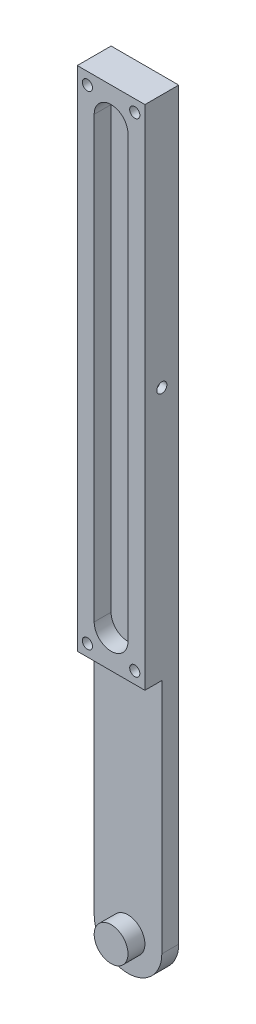
ISO-10303-21;
HEADER;
FILE_DESCRIPTION(('STEP AP214'),'2;1');
FILE_NAME('part.step','',(''),(''),'','','');
FILE_SCHEMA(('AUTOMOTIVE_DESIGN { 1 0 10303 214 1 1 1 1 }'));
ENDSEC;
DATA;
#1=APPLICATION_CONTEXT('core data for automotive mechanical design processes');
#2=APPLICATION_PROTOCOL_DEFINITION('international standard','automotive_design',2000,#1);
#3=PRODUCT_CONTEXT('',#1,'mechanical');
#4=PRODUCT('Part','Part','',(#3));
#5=PRODUCT_RELATED_PRODUCT_CATEGORY('part','',(#4));
#6=PRODUCT_DEFINITION_FORMATION('','',#4);
#7=PRODUCT_DEFINITION_CONTEXT('part definition',#1,'design');
#8=PRODUCT_DEFINITION('design','',#6,#7);
#9=PRODUCT_DEFINITION_SHAPE('','',#8);
#10=(LENGTH_UNIT() NAMED_UNIT(*) SI_UNIT(.MILLI.,.METRE.));
#11=(NAMED_UNIT(*) PLANE_ANGLE_UNIT() SI_UNIT($,.RADIAN.));
#12=(NAMED_UNIT(*) SI_UNIT($,.STERADIAN.) SOLID_ANGLE_UNIT());
#13=UNCERTAINTY_MEASURE_WITH_UNIT(LENGTH_MEASURE(1.E-05),#10,'distance_accuracy_value','');
#14=(GEOMETRIC_REPRESENTATION_CONTEXT(3) GLOBAL_UNCERTAINTY_ASSIGNED_CONTEXT((#13)) GLOBAL_UNIT_ASSIGNED_CONTEXT((#10,
#11,#12)) REPRESENTATION_CONTEXT('',''));
#15=CARTESIAN_POINT('',(0.,0.,0.));
#16=DIRECTION('',(0.,0.,1.));
#17=DIRECTION('',(1.,0.,0.));
#18=AXIS2_PLACEMENT_3D('',#15,#16,#17);
#19=CARTESIAN_POINT('',(10.,-150.,5.));
#20=DIRECTION('',(-1.,0.,0.));
#21=DIRECTION('',(0.,-1.,0.));
#22=AXIS2_PLACEMENT_3D('',#19,#20,#21);
#23=PLANE('',#22);
#24=DIRECTION('',(0.,1.,0.));
#25=VECTOR('',#24,1.);
#26=CARTESIAN_POINT('',(10.,-150.,-5.));
#27=LINE('',#26,#25);
#28=CARTESIAN_POINT('',(10.,-220.,-5.));
#29=VERTEX_POINT('',#28);
#30=CARTESIAN_POINT('',(10.,0.,-5.));
#31=VERTEX_POINT('',#30);
#32=EDGE_CURVE('E97',#29,#31,#27,.T.);
#33=ORIENTED_EDGE('',*,*,#32,.T.);
#34=DIRECTION('',(0.,0.,-1.));
#35=VECTOR('',#34,1.);
#36=CARTESIAN_POINT('',(10.,0.,5.));
#37=LINE('',#36,#35);
#38=CARTESIAN_POINT('',(10.,0.,5.));
#39=VERTEX_POINT('',#38);
#40=EDGE_CURVE('E10',#39,#31,#37,.T.);
#41=ORIENTED_EDGE('',*,*,#40,.F.);
#42=DIRECTION('',(0.,1.,0.));
#43=VECTOR('',#42,1.);
#44=CARTESIAN_POINT('',(10.,-150.,5.));
#45=LINE('',#44,#43);
#46=CARTESIAN_POINT('',(10.,-150.,5.));
#47=VERTEX_POINT('',#46);
#48=EDGE_CURVE('E180',#47,#39,#45,.T.);
#49=ORIENTED_EDGE('',*,*,#48,.F.);
#50=DIRECTION('',(0.,0.,-1.));
#51=VECTOR('',#50,1.);
#52=CARTESIAN_POINT('',(10.,-150.,5.));
#53=LINE('',#52,#51);
#54=CARTESIAN_POINT('',(10.,-150.,0.));
#55=VERTEX_POINT('',#54);
#56=EDGE_CURVE('E189',#47,#55,#53,.T.);
#57=ORIENTED_EDGE('',*,*,#56,.T.);
#58=DIRECTION('',(0.,1.,0.));
#59=VECTOR('',#58,1.);
#60=CARTESIAN_POINT('',(10.,-150.,0.));
#61=LINE('',#60,#59);
#62=CARTESIAN_POINT('',(10.,-220.,0.));
#63=VERTEX_POINT('',#62);
#64=EDGE_CURVE('E113',#63,#55,#61,.T.);
#65=ORIENTED_EDGE('',*,*,#64,.F.);
#66=DIRECTION('',(0.,0.,1.));
#67=VECTOR('',#66,1.);
#68=CARTESIAN_POINT('',(10.,-220.,-87.4621125123532));
#69=LINE('',#68,#67);
#70=EDGE_CURVE('E110',#29,#63,#69,.T.);
#71=ORIENTED_EDGE('',*,*,#70,.F.);
#72=EDGE_LOOP('',(#33,#41,#49,#57,#65,#71));
#73=FACE_BOUND('',#72,.T.);
#74=CARTESIAN_POINT('',(10.,-75.,0.));
#75=DIRECTION('',(-1.,0.,0.));
#76=DIRECTION('',(0.,-1.,0.));
#77=AXIS2_PLACEMENT_3D('',#74,#75,#76);
#78=CIRCLE('',#77,1.5);
#79=CARTESIAN_POINT('',(10.,-76.5,0.));
#80=VERTEX_POINT('',#79);
#81=EDGE_CURVE('E214',#80,#80,#78,.T.);
#82=ORIENTED_EDGE('',*,*,#81,.T.);
#83=EDGE_LOOP('',(#82));
#84=FACE_BOUND('',#83,.T.);
#85=ADVANCED_FACE('F18',(#73,#84),#23,.F.);
#86=CARTESIAN_POINT('',(0.,-220.,0.));
#87=DIRECTION('',(0.,0.,1.));
#88=DIRECTION('',(0.,-1.,0.));
#89=AXIS2_PLACEMENT_3D('',#86,#87,#88);
#90=PLANE('',#89);
#91=DIRECTION('',(0.,-1.,0.));
#92=VECTOR('',#91,1.);
#93=CARTESIAN_POINT('',(-10.,-150.,0.));
#94=LINE('',#93,#92);
#95=CARTESIAN_POINT('',(-10.,-150.,0.));
#96=VERTEX_POINT('',#95);
#97=CARTESIAN_POINT('',(-10.,-220.,0.));
#98=VERTEX_POINT('',#97);
#99=EDGE_CURVE('E201',#96,#98,#94,.T.);
#100=ORIENTED_EDGE('',*,*,#99,.T.);
#101=CARTESIAN_POINT('',(0.,-220.,0.));
#102=DIRECTION('',(0.,0.,1.));
#103=DIRECTION('',(0.,-1.,0.));
#104=AXIS2_PLACEMENT_3D('',#101,#102,#103);
#105=CIRCLE('',#104,10.);
#106=EDGE_CURVE('E123',#98,#63,#105,.T.);
#107=ORIENTED_EDGE('',*,*,#106,.T.);
#108=ORIENTED_EDGE('',*,*,#64,.T.);
#109=DIRECTION('',(-1.,0.,0.));
#110=VECTOR('',#109,1.);
#111=CARTESIAN_POINT('',(-10.,-150.,0.));
#112=LINE('',#111,#110);
#113=EDGE_CURVE('E34',#55,#96,#112,.T.);
#114=ORIENTED_EDGE('',*,*,#113,.T.);
#115=EDGE_LOOP('',(#100,#107,#108,#114));
#116=FACE_BOUND('',#115,.T.);
#117=CARTESIAN_POINT('',(0.,-220.,0.));
#118=DIRECTION('',(0.,0.,1.));
#119=DIRECTION('',(0.,-1.,0.));
#120=AXIS2_PLACEMENT_3D('',#117,#118,#119);
#121=CIRCLE('',#120,5.);
#122=CARTESIAN_POINT('',(0.,-225.,0.));
#123=VERTEX_POINT('',#122);
#124=EDGE_CURVE('E208',#123,#123,#121,.T.);
#125=ORIENTED_EDGE('',*,*,#124,.F.);
#126=EDGE_LOOP('',(#125));
#127=FACE_BOUND('',#126,.T.);
#128=ADVANCED_FACE('F233',(#116,#127),#90,.T.);
#129=CARTESIAN_POINT('',(-10.,-150.,5.));
#130=DIRECTION('',(0.,1.,0.));
#131=DIRECTION('',(-1.,0.,0.));
#132=AXIS2_PLACEMENT_3D('',#129,#130,#131);
#133=PLANE('',#132);
#134=ORIENTED_EDGE('',*,*,#113,.F.);
#135=ORIENTED_EDGE('',*,*,#56,.F.);
#136=DIRECTION('',(1.,0.,0.));
#137=VECTOR('',#136,1.);
#138=CARTESIAN_POINT('',(-10.,-150.,5.));
#139=LINE('',#138,#137);
#140=CARTESIAN_POINT('',(-10.,-150.,5.));
#141=VERTEX_POINT('',#140);
#142=EDGE_CURVE('E188',#141,#47,#139,.T.);
#143=ORIENTED_EDGE('',*,*,#142,.F.);
#144=DIRECTION('',(0.,0.,-1.));
#145=VECTOR('',#144,1.);
#146=CARTESIAN_POINT('',(-10.,-150.,5.));
#147=LINE('',#146,#145);
#148=EDGE_CURVE('E199',#141,#96,#147,.T.);
#149=ORIENTED_EDGE('',*,*,#148,.T.);
#150=EDGE_LOOP('',(#134,#135,#143,#149));
#151=FACE_BOUND('',#150,.T.);
#152=ADVANCED_FACE('F237',(#151),#133,.F.);
#153=CARTESIAN_POINT('',(-10.,0.,5.));
#154=DIRECTION('',(0.,-1.,0.));
#155=DIRECTION('',(1.,0.,0.));
#156=AXIS2_PLACEMENT_3D('',#153,#154,#155);
#157=PLANE('',#156);
#158=DIRECTION('',(-1.,0.,0.));
#159=VECTOR('',#158,1.);
#160=CARTESIAN_POINT('',(-10.,0.,-5.));
#161=LINE('',#160,#159);
#162=CARTESIAN_POINT('',(-10.,0.,-5.));
#163=VERTEX_POINT('',#162);
#164=EDGE_CURVE('E104',#31,#163,#161,.T.);
#165=ORIENTED_EDGE('',*,*,#164,.T.);
#166=DIRECTION('',(0.,0.,-1.));
#167=VECTOR('',#166,1.);
#168=CARTESIAN_POINT('',(-10.,0.,5.));
#169=LINE('',#168,#167);
#170=CARTESIAN_POINT('',(-10.,0.,5.));
#171=VERTEX_POINT('',#170);
#172=EDGE_CURVE('E26',#171,#163,#169,.T.);
#173=ORIENTED_EDGE('',*,*,#172,.F.);
#174=DIRECTION('',(-1.,0.,0.));
#175=VECTOR('',#174,1.);
#176=CARTESIAN_POINT('',(-10.,0.,5.));
#177=LINE('',#176,#175);
#178=EDGE_CURVE('E183',#39,#171,#177,.T.);
#179=ORIENTED_EDGE('',*,*,#178,.F.);
#180=ORIENTED_EDGE('',*,*,#40,.T.);
#181=EDGE_LOOP('',(#165,#173,#179,#180));
#182=FACE_BOUND('',#181,.T.);
#183=ADVANCED_FACE('F243',(#182),#157,.F.);
#184=CARTESIAN_POINT('',(-10.,-150.,5.));
#185=DIRECTION('',(1.,0.,0.));
#186=DIRECTION('',(0.,1.,0.));
#187=AXIS2_PLACEMENT_3D('',#184,#185,#186);
#188=PLANE('',#187);
#189=DIRECTION('',(0.,-1.,0.));
#190=VECTOR('',#189,1.);
#191=CARTESIAN_POINT('',(-10.,-150.,-5.));
#192=LINE('',#191,#190);
#193=CARTESIAN_POINT('',(-10.,-220.,-5.));
#194=VERTEX_POINT('',#193);
#195=EDGE_CURVE('E184',#163,#194,#192,.T.);
#196=ORIENTED_EDGE('',*,*,#195,.T.);
#197=DIRECTION('',(0.,0.,1.));
#198=VECTOR('',#197,1.);
#199=CARTESIAN_POINT('',(-10.,-220.,-87.4621125123532));
#200=LINE('',#199,#198);
#201=EDGE_CURVE('E117',#194,#98,#200,.T.);
#202=ORIENTED_EDGE('',*,*,#201,.T.);
#203=ORIENTED_EDGE('',*,*,#99,.F.);
#204=ORIENTED_EDGE('',*,*,#148,.F.);
#205=DIRECTION('',(0.,-1.,0.));
#206=VECTOR('',#205,1.);
#207=CARTESIAN_POINT('',(-10.,-150.,5.));
#208=LINE('',#207,#206);
#209=EDGE_CURVE('E186',#171,#141,#208,.T.);
#210=ORIENTED_EDGE('',*,*,#209,.F.);
#211=ORIENTED_EDGE('',*,*,#172,.T.);
#212=EDGE_LOOP('',(#196,#202,#203,#204,#210,#211));
#213=FACE_BOUND('',#212,.T.);
#214=ADVANCED_FACE('F306',(#213),#188,.F.);
#215=CARTESIAN_POINT('',(0.,-75.,5.));
#216=DIRECTION('',(0.,0.,-1.));
#217=DIRECTION('',(0.,1.,0.));
#218=AXIS2_PLACEMENT_3D('',#215,#216,#217);
#219=PLANE('',#218);
#220=CARTESIAN_POINT('',(7.,-146.5,5.));
#221=DIRECTION('',(0.,0.,1.));
#222=DIRECTION('',(0.,-1.,0.));
#223=AXIS2_PLACEMENT_3D('',#220,#221,#222);
#224=CIRCLE('',#223,1.5);
#225=CARTESIAN_POINT('',(7.,-148.,5.));
#226=VERTEX_POINT('',#225);
#227=EDGE_CURVE('E127',#226,#226,#224,.T.);
#228=ORIENTED_EDGE('',*,*,#227,.F.);
#229=EDGE_LOOP('',(#228));
#230=FACE_BOUND('',#229,.T.);
#231=CARTESIAN_POINT('',(-7.,-146.5,5.));
#232=DIRECTION('',(0.,0.,1.));
#233=DIRECTION('',(0.,-1.,0.));
#234=AXIS2_PLACEMENT_3D('',#231,#232,#233);
#235=CIRCLE('',#234,1.5);
#236=CARTESIAN_POINT('',(-7.,-148.,5.));
#237=VERTEX_POINT('',#236);
#238=EDGE_CURVE('E131',#237,#237,#235,.T.);
#239=ORIENTED_EDGE('',*,*,#238,.F.);
#240=EDGE_LOOP('',(#239));
#241=FACE_BOUND('',#240,.T.);
#242=CARTESIAN_POINT('',(-7.,-3.5,5.));
#243=DIRECTION('',(0.,0.,1.));
#244=DIRECTION('',(0.,-1.,0.));
#245=AXIS2_PLACEMENT_3D('',#242,#243,#244);
#246=CIRCLE('',#245,1.5);
#247=CARTESIAN_POINT('',(-7.,-5.,5.));
#248=VERTEX_POINT('',#247);
#249=EDGE_CURVE('E137',#248,#248,#246,.T.);
#250=ORIENTED_EDGE('',*,*,#249,.F.);
#251=EDGE_LOOP('',(#250));
#252=FACE_BOUND('',#251,.T.);
#253=CARTESIAN_POINT('',(7.,-3.5,5.));
#254=DIRECTION('',(0.,0.,1.));
#255=DIRECTION('',(0.,-1.,0.));
#256=AXIS2_PLACEMENT_3D('',#253,#254,#255);
#257=CIRCLE('',#256,1.5);
#258=CARTESIAN_POINT('',(7.,-5.,5.));
#259=VERTEX_POINT('',#258);
#260=EDGE_CURVE('E143',#259,#259,#257,.T.);
#261=ORIENTED_EDGE('',*,*,#260,.F.);
#262=EDGE_LOOP('',(#261));
#263=FACE_BOUND('',#262,.T.);
#264=DIRECTION('',(0.,1.,0.));
#265=VECTOR('',#264,1.);
#266=CARTESIAN_POINT('',(5.,-140.,5.));
#267=LINE('',#266,#265);
#268=CARTESIAN_POINT('',(5.,-140.,5.));
#269=VERTEX_POINT('',#268);
#270=CARTESIAN_POINT('',(5.,-10.,5.));
#271=VERTEX_POINT('',#270);
#272=EDGE_CURVE('E166',#269,#271,#267,.T.);
#273=ORIENTED_EDGE('',*,*,#272,.F.);
#274=CARTESIAN_POINT('',(0.,-140.,5.));
#275=DIRECTION('',(0.,0.,1.));
#276=DIRECTION('',(0.,-1.,0.));
#277=AXIS2_PLACEMENT_3D('',#274,#275,#276);
#278=CIRCLE('',#277,5.);
#279=CARTESIAN_POINT('',(-5.,-140.,5.));
#280=VERTEX_POINT('',#279);
#281=EDGE_CURVE('E42',#280,#269,#278,.T.);
#282=ORIENTED_EDGE('',*,*,#281,.F.);
#283=DIRECTION('',(0.,-1.,0.));
#284=VECTOR('',#283,1.);
#285=CARTESIAN_POINT('',(-5.,-140.,5.));
#286=LINE('',#285,#284);
#287=CARTESIAN_POINT('',(-5.,-10.,5.));
#288=VERTEX_POINT('',#287);
#289=EDGE_CURVE('E155',#288,#280,#286,.T.);
#290=ORIENTED_EDGE('',*,*,#289,.F.);
#291=CARTESIAN_POINT('',(0.,-10.,5.));
#292=DIRECTION('',(0.,0.,1.));
#293=DIRECTION('',(0.,-1.,0.));
#294=AXIS2_PLACEMENT_3D('',#291,#292,#293);
#295=CIRCLE('',#294,5.);
#296=EDGE_CURVE('E169',#271,#288,#295,.T.);
#297=ORIENTED_EDGE('',*,*,#296,.F.);
#298=EDGE_LOOP('',(#273,#282,#290,#297));
#299=FACE_BOUND('',#298,.T.);
#300=ORIENTED_EDGE('',*,*,#48,.T.);
#301=ORIENTED_EDGE('',*,*,#178,.T.);
#302=ORIENTED_EDGE('',*,*,#209,.T.);
#303=ORIENTED_EDGE('',*,*,#142,.T.);
#304=EDGE_LOOP('',(#300,#301,#302,#303));
#305=FACE_BOUND('',#304,.T.);
#306=ADVANCED_FACE('F303',(#230,#241,#252,#263,#299,#305),#219,.F.);
#307=CARTESIAN_POINT('',(0.,-75.,-5.));
#308=DIRECTION('',(0.,0.,-1.));
#309=DIRECTION('',(0.,1.,0.));
#310=AXIS2_PLACEMENT_3D('',#307,#308,#309);
#311=PLANE('',#310);
#312=ORIENTED_EDGE('',*,*,#32,.F.);
#313=CARTESIAN_POINT('',(0.,-220.,-5.));
#314=DIRECTION('',(0.,0.,-1.));
#315=DIRECTION('',(0.,1.,0.));
#316=AXIS2_PLACEMENT_3D('',#313,#314,#315);
#317=CIRCLE('',#316,10.);
#318=EDGE_CURVE('E102',#194,#29,#317,.F.);
#319=ORIENTED_EDGE('',*,*,#318,.F.);
#320=ORIENTED_EDGE('',*,*,#195,.F.);
#321=ORIENTED_EDGE('',*,*,#164,.F.);
#322=EDGE_LOOP('',(#312,#319,#320,#321));
#323=FACE_BOUND('',#322,.T.);
#324=ADVANCED_FACE('F99',(#323),#311,.T.);
#325=CARTESIAN_POINT('',(0.,-140.,0.));
#326=DIRECTION('',(0.,0.,1.));
#327=DIRECTION('',(0.,-1.,0.));
#328=AXIS2_PLACEMENT_3D('',#325,#326,#327);
#329=CYLINDRICAL_SURFACE('',#328,5.);
#330=ORIENTED_EDGE('',*,*,#281,.T.);
#331=DIRECTION('',(0.,0.,1.));
#332=VECTOR('',#331,1.);
#333=CARTESIAN_POINT('',(5.,-140.,0.));
#334=LINE('',#333,#332);
#335=CARTESIAN_POINT('',(5.,-140.,0.));
#336=VERTEX_POINT('',#335);
#337=EDGE_CURVE('E164',#336,#269,#334,.T.);
#338=ORIENTED_EDGE('',*,*,#337,.F.);
#339=CARTESIAN_POINT('',(0.,-140.,0.));
#340=DIRECTION('',(0.,0.,1.));
#341=DIRECTION('',(0.,-1.,0.));
#342=AXIS2_PLACEMENT_3D('',#339,#340,#341);
#343=CIRCLE('',#342,5.);
#344=CARTESIAN_POINT('',(-5.,-140.,0.));
#345=VERTEX_POINT('',#344);
#346=EDGE_CURVE('E151',#345,#336,#343,.T.);
#347=ORIENTED_EDGE('',*,*,#346,.F.);
#348=DIRECTION('',(0.,0.,1.));
#349=VECTOR('',#348,1.);
#350=CARTESIAN_POINT('',(-5.,-140.,0.));
#351=LINE('',#350,#349);
#352=EDGE_CURVE('E107',#345,#280,#351,.T.);
#353=ORIENTED_EDGE('',*,*,#352,.T.);
#354=EDGE_LOOP('',(#330,#338,#347,#353));
#355=FACE_BOUND('',#354,.T.);
#356=ADVANCED_FACE('F293',(#355),#329,.F.);
#357=CARTESIAN_POINT('',(-5.,-140.,0.));
#358=DIRECTION('',(-1.,0.,0.));
#359=DIRECTION('',(0.,-1.,0.));
#360=AXIS2_PLACEMENT_3D('',#357,#358,#359);
#361=PLANE('',#360);
#362=ORIENTED_EDGE('',*,*,#289,.T.);
#363=ORIENTED_EDGE('',*,*,#352,.F.);
#364=DIRECTION('',(0.,-1.,0.));
#365=VECTOR('',#364,1.);
#366=CARTESIAN_POINT('',(-5.,-140.,0.));
#367=LINE('',#366,#365);
#368=CARTESIAN_POINT('',(-5.,-10.,0.));
#369=VERTEX_POINT('',#368);
#370=EDGE_CURVE('E161',#369,#345,#367,.T.);
#371=ORIENTED_EDGE('',*,*,#370,.F.);
#372=DIRECTION('',(0.,0.,1.));
#373=VECTOR('',#372,1.);
#374=CARTESIAN_POINT('',(-5.,-10.,0.));
#375=LINE('',#374,#373);
#376=EDGE_CURVE('E175',#369,#288,#375,.T.);
#377=ORIENTED_EDGE('',*,*,#376,.T.);
#378=EDGE_LOOP('',(#362,#363,#371,#377));
#379=FACE_BOUND('',#378,.T.);
#380=ADVANCED_FACE('F289',(#379),#361,.F.);
#381=CARTESIAN_POINT('',(0.,-10.,0.));
#382=DIRECTION('',(0.,0.,1.));
#383=DIRECTION('',(0.,-1.,0.));
#384=AXIS2_PLACEMENT_3D('',#381,#382,#383);
#385=CYLINDRICAL_SURFACE('',#384,5.);
#386=ORIENTED_EDGE('',*,*,#296,.T.);
#387=ORIENTED_EDGE('',*,*,#376,.F.);
#388=CARTESIAN_POINT('',(0.,-10.,0.));
#389=DIRECTION('',(0.,0.,1.));
#390=DIRECTION('',(0.,-1.,0.));
#391=AXIS2_PLACEMENT_3D('',#388,#389,#390);
#392=CIRCLE('',#391,5.);
#393=CARTESIAN_POINT('',(5.,-10.,0.));
#394=VERTEX_POINT('',#393);
#395=EDGE_CURVE('E158',#394,#369,#392,.T.);
#396=ORIENTED_EDGE('',*,*,#395,.F.);
#397=DIRECTION('',(0.,0.,1.));
#398=VECTOR('',#397,1.);
#399=CARTESIAN_POINT('',(5.,-10.,0.));
#400=LINE('',#399,#398);
#401=EDGE_CURVE('E177',#394,#271,#400,.T.);
#402=ORIENTED_EDGE('',*,*,#401,.T.);
#403=EDGE_LOOP('',(#386,#387,#396,#402));
#404=FACE_BOUND('',#403,.T.);
#405=ADVANCED_FACE('F292',(#404),#385,.F.);
#406=CARTESIAN_POINT('',(5.,-140.,0.));
#407=DIRECTION('',(1.,0.,0.));
#408=DIRECTION('',(0.,1.,0.));
#409=AXIS2_PLACEMENT_3D('',#406,#407,#408);
#410=PLANE('',#409);
#411=ORIENTED_EDGE('',*,*,#272,.T.);
#412=ORIENTED_EDGE('',*,*,#401,.F.);
#413=DIRECTION('',(0.,1.,0.));
#414=VECTOR('',#413,1.);
#415=CARTESIAN_POINT('',(5.,-140.,0.));
#416=LINE('',#415,#414);
#417=EDGE_CURVE('E154',#336,#394,#416,.T.);
#418=ORIENTED_EDGE('',*,*,#417,.F.);
#419=ORIENTED_EDGE('',*,*,#337,.T.);
#420=EDGE_LOOP('',(#411,#412,#418,#419));
#421=FACE_BOUND('',#420,.T.);
#422=ADVANCED_FACE('F287',(#421),#410,.F.);
#423=CARTESIAN_POINT('',(0.,-140.,0.));
#424=DIRECTION('',(0.,0.,1.));
#425=DIRECTION('',(0.,-1.,0.));
#426=AXIS2_PLACEMENT_3D('',#423,#424,#425);
#427=PLANE('',#426);
#428=ORIENTED_EDGE('',*,*,#346,.T.);
#429=ORIENTED_EDGE('',*,*,#417,.T.);
#430=ORIENTED_EDGE('',*,*,#395,.T.);
#431=ORIENTED_EDGE('',*,*,#370,.T.);
#432=EDGE_LOOP('',(#428,#429,#430,#431));
#433=FACE_BOUND('',#432,.T.);
#434=ADVANCED_FACE('F283',(#433),#427,.T.);
#435=CARTESIAN_POINT('',(7.,-3.5,0.));
#436=DIRECTION('',(0.,0.,1.));
#437=DIRECTION('',(0.,-1.,0.));
#438=AXIS2_PLACEMENT_3D('',#435,#436,#437);
#439=CYLINDRICAL_SURFACE('',#438,1.5);
#440=CARTESIAN_POINT('',(7.,-3.5,0.));
#441=DIRECTION('',(0.,0.,1.));
#442=DIRECTION('',(0.,-1.,0.));
#443=AXIS2_PLACEMENT_3D('',#440,#441,#442);
#444=CIRCLE('',#443,1.5);
#445=CARTESIAN_POINT('',(7.,-5.,0.));
#446=VERTEX_POINT('',#445);
#447=EDGE_CURVE('E146',#446,#446,#444,.T.);
#448=ORIENTED_EDGE('',*,*,#447,.F.);
#449=EDGE_LOOP('',(#448));
#450=FACE_BOUND('',#449,.T.);
#451=ORIENTED_EDGE('',*,*,#260,.T.);
#452=EDGE_LOOP('',(#451));
#453=FACE_BOUND('',#452,.T.);
#454=ADVANCED_FACE('F279',(#450,#453),#439,.F.);
#455=CARTESIAN_POINT('',(7.,-3.5,0.));
#456=DIRECTION('',(0.,0.,1.));
#457=DIRECTION('',(0.,-1.,0.));
#458=AXIS2_PLACEMENT_3D('',#455,#456,#457);
#459=PLANE('',#458);
#460=ORIENTED_EDGE('',*,*,#447,.T.);
#461=EDGE_LOOP('',(#460));
#462=FACE_BOUND('',#461,.T.);
#463=ADVANCED_FACE('F275',(#462),#459,.T.);
#464=CARTESIAN_POINT('',(-7.,-3.5,0.));
#465=DIRECTION('',(0.,0.,1.));
#466=DIRECTION('',(0.,-1.,0.));
#467=AXIS2_PLACEMENT_3D('',#464,#465,#466);
#468=CYLINDRICAL_SURFACE('',#467,1.5);
#469=CARTESIAN_POINT('',(-7.,-3.5,0.));
#470=DIRECTION('',(0.,0.,1.));
#471=DIRECTION('',(0.,-1.,0.));
#472=AXIS2_PLACEMENT_3D('',#469,#470,#471);
#473=CIRCLE('',#472,1.5);
#474=CARTESIAN_POINT('',(-7.,-5.,0.));
#475=VERTEX_POINT('',#474);
#476=EDGE_CURVE('E140',#475,#475,#473,.T.);
#477=ORIENTED_EDGE('',*,*,#476,.F.);
#478=EDGE_LOOP('',(#477));
#479=FACE_BOUND('',#478,.T.);
#480=ORIENTED_EDGE('',*,*,#249,.T.);
#481=EDGE_LOOP('',(#480));
#482=FACE_BOUND('',#481,.T.);
#483=ADVANCED_FACE('F271',(#479,#482),#468,.F.);
#484=CARTESIAN_POINT('',(-7.,-3.5,0.));
#485=DIRECTION('',(0.,0.,1.));
#486=DIRECTION('',(0.,-1.,0.));
#487=AXIS2_PLACEMENT_3D('',#484,#485,#486);
#488=PLANE('',#487);
#489=ORIENTED_EDGE('',*,*,#476,.T.);
#490=EDGE_LOOP('',(#489));
#491=FACE_BOUND('',#490,.T.);
#492=ADVANCED_FACE('F267',(#491),#488,.T.);
#493=CARTESIAN_POINT('',(-7.,-146.5,0.));
#494=DIRECTION('',(0.,0.,1.));
#495=DIRECTION('',(0.,-1.,0.));
#496=AXIS2_PLACEMENT_3D('',#493,#494,#495);
#497=CYLINDRICAL_SURFACE('',#496,1.5);
#498=CARTESIAN_POINT('',(-7.,-146.5,0.));
#499=DIRECTION('',(0.,0.,1.));
#500=DIRECTION('',(0.,-1.,0.));
#501=AXIS2_PLACEMENT_3D('',#498,#499,#500);
#502=CIRCLE('',#501,1.5);
#503=CARTESIAN_POINT('',(-7.,-148.,0.));
#504=VERTEX_POINT('',#503);
#505=EDGE_CURVE('E134',#504,#504,#502,.T.);
#506=ORIENTED_EDGE('',*,*,#505,.F.);
#507=EDGE_LOOP('',(#506));
#508=FACE_BOUND('',#507,.T.);
#509=ORIENTED_EDGE('',*,*,#238,.T.);
#510=EDGE_LOOP('',(#509));
#511=FACE_BOUND('',#510,.T.);
#512=ADVANCED_FACE('F263',(#508,#511),#497,.F.);
#513=CARTESIAN_POINT('',(-7.,-146.5,0.));
#514=DIRECTION('',(0.,0.,1.));
#515=DIRECTION('',(0.,-1.,0.));
#516=AXIS2_PLACEMENT_3D('',#513,#514,#515);
#517=PLANE('',#516);
#518=ORIENTED_EDGE('',*,*,#505,.T.);
#519=EDGE_LOOP('',(#518));
#520=FACE_BOUND('',#519,.T.);
#521=ADVANCED_FACE('F259',(#520),#517,.T.);
#522=CARTESIAN_POINT('',(7.,-146.5,0.));
#523=DIRECTION('',(0.,0.,1.));
#524=DIRECTION('',(0.,-1.,0.));
#525=AXIS2_PLACEMENT_3D('',#522,#523,#524);
#526=CYLINDRICAL_SURFACE('',#525,1.5);
#527=CARTESIAN_POINT('',(7.,-146.5,0.));
#528=DIRECTION('',(0.,0.,1.));
#529=DIRECTION('',(0.,-1.,0.));
#530=AXIS2_PLACEMENT_3D('',#527,#528,#529);
#531=CIRCLE('',#530,1.5);
#532=CARTESIAN_POINT('',(7.,-148.,0.));
#533=VERTEX_POINT('',#532);
#534=EDGE_CURVE('E128',#533,#533,#531,.T.);
#535=ORIENTED_EDGE('',*,*,#534,.F.);
#536=EDGE_LOOP('',(#535));
#537=FACE_BOUND('',#536,.T.);
#538=ORIENTED_EDGE('',*,*,#227,.T.);
#539=EDGE_LOOP('',(#538));
#540=FACE_BOUND('',#539,.T.);
#541=ADVANCED_FACE('F255',(#537,#540),#526,.F.);
#542=CARTESIAN_POINT('',(7.,-146.5,0.));
#543=DIRECTION('',(0.,0.,1.));
#544=DIRECTION('',(0.,-1.,0.));
#545=AXIS2_PLACEMENT_3D('',#542,#543,#544);
#546=PLANE('',#545);
#547=ORIENTED_EDGE('',*,*,#534,.T.);
#548=EDGE_LOOP('',(#547));
#549=FACE_BOUND('',#548,.T.);
#550=ADVANCED_FACE('F252',(#549),#546,.T.);
#551=CARTESIAN_POINT('',(0.,-220.,-87.4621125123532));
#552=DIRECTION('',(0.,0.,1.));
#553=DIRECTION('',(0.,-1.,0.));
#554=AXIS2_PLACEMENT_3D('',#551,#552,#553);
#555=CYLINDRICAL_SURFACE('',#554,10.);
#556=ORIENTED_EDGE('',*,*,#201,.F.);
#557=ORIENTED_EDGE('',*,*,#318,.T.);
#558=ORIENTED_EDGE('',*,*,#70,.T.);
#559=ORIENTED_EDGE('',*,*,#106,.F.);
#560=EDGE_LOOP('',(#556,#557,#558,#559));
#561=FACE_BOUND('',#560,.T.);
#562=ADVANCED_FACE('F119',(#561),#555,.T.);
#563=CARTESIAN_POINT('',(0.,-220.,5.));
#564=DIRECTION('',(0.,0.,-1.));
#565=DIRECTION('',(0.,1.,0.));
#566=AXIS2_PLACEMENT_3D('',#563,#564,#565);
#567=CYLINDRICAL_SURFACE('',#566,5.);
#568=CARTESIAN_POINT('',(0.,-220.,5.));
#569=DIRECTION('',(0.,0.,1.));
#570=DIRECTION('',(0.,-1.,0.));
#571=AXIS2_PLACEMENT_3D('',#568,#569,#570);
#572=CIRCLE('',#571,5.);
#573=CARTESIAN_POINT('',(0.,-225.,5.));
#574=VERTEX_POINT('',#573);
#575=EDGE_CURVE('E204',#574,#574,#572,.T.);
#576=ORIENTED_EDGE('',*,*,#575,.F.);
#577=EDGE_LOOP('',(#576));
#578=FACE_BOUND('',#577,.T.);
#579=ORIENTED_EDGE('',*,*,#124,.T.);
#580=EDGE_LOOP('',(#579));
#581=FACE_BOUND('',#580,.T.);
#582=ADVANCED_FACE('F248',(#578,#581),#567,.T.);
#583=CARTESIAN_POINT('',(0.,-220.,5.));
#584=DIRECTION('',(0.,0.,1.));
#585=DIRECTION('',(0.,-1.,0.));
#586=AXIS2_PLACEMENT_3D('',#583,#584,#585);
#587=PLANE('',#586);
#588=ORIENTED_EDGE('',*,*,#575,.T.);
#589=EDGE_LOOP('',(#588));
#590=FACE_BOUND('',#589,.T.);
#591=ADVANCED_FACE('F230',(#590),#587,.T.);
#592=CARTESIAN_POINT('',(8.,-75.,0.));
#593=DIRECTION('',(1.,0.,0.));
#594=DIRECTION('',(0.,1.,0.));
#595=AXIS2_PLACEMENT_3D('',#592,#593,#594);
#596=CYLINDRICAL_SURFACE('',#595,1.5);
#597=CARTESIAN_POINT('',(8.,-75.,0.));
#598=DIRECTION('',(-1.,0.,0.));
#599=DIRECTION('',(0.,-1.,0.));
#600=AXIS2_PLACEMENT_3D('',#597,#598,#599);
#601=CIRCLE('',#600,1.5);
#602=CARTESIAN_POINT('',(8.,-76.5,0.));
#603=VERTEX_POINT('',#602);
#604=EDGE_CURVE('E211',#603,#603,#601,.T.);
#605=ORIENTED_EDGE('',*,*,#604,.T.);
#606=EDGE_LOOP('',(#605));
#607=FACE_BOUND('',#606,.T.);
#608=ORIENTED_EDGE('',*,*,#81,.F.);
#609=EDGE_LOOP('',(#608));
#610=FACE_BOUND('',#609,.T.);
#611=ADVANCED_FACE('F220',(#607,#610),#596,.F.);
#612=CARTESIAN_POINT('',(8.,-75.,0.));
#613=DIRECTION('',(-1.,0.,0.));
#614=DIRECTION('',(0.,-1.,0.));
#615=AXIS2_PLACEMENT_3D('',#612,#613,#614);
#616=PLANE('',#615);
#617=ORIENTED_EDGE('',*,*,#604,.F.);
#618=EDGE_LOOP('',(#617));
#619=FACE_BOUND('',#618,.T.);
#620=ADVANCED_FACE('F223',(#619),#616,.F.);
#621=CLOSED_SHELL('',(#85,#128,#152,#183,#214,#306,#324,#356,#380,#405,#422,#434,#454,#463,#483,
#492,#512,#521,#541,#550,#562,#582,#591,#611,#620));
#622=MANIFOLD_SOLID_BREP('B1',#621);
#623=ADVANCED_BREP_SHAPE_REPRESENTATION('',(#18,#622),#14);
#624=SHAPE_DEFINITION_REPRESENTATION(#9,#623);
ENDSEC;
END-ISO-10303-21;
